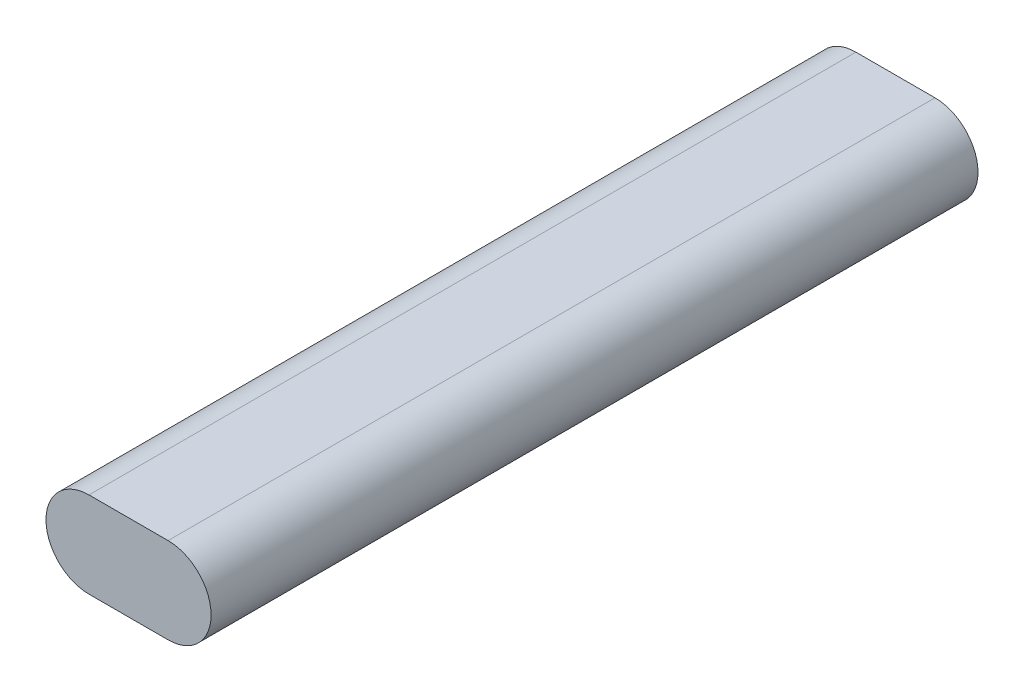
ISO-10303-21;
HEADER;
FILE_DESCRIPTION(('STEP AP214'),'2;1');
FILE_NAME('part.step','',(''),(''),'','','');
FILE_SCHEMA(('AUTOMOTIVE_DESIGN { 1 0 10303 214 1 1 1 1 }'));
ENDSEC;
DATA;
#1=APPLICATION_CONTEXT('core data for automotive mechanical design processes');
#2=APPLICATION_PROTOCOL_DEFINITION('international standard','automotive_design',2000,#1);
#3=PRODUCT_CONTEXT('',#1,'mechanical');
#4=PRODUCT('Part','Part','',(#3));
#5=PRODUCT_RELATED_PRODUCT_CATEGORY('part','',(#4));
#6=PRODUCT_DEFINITION_FORMATION('','',#4);
#7=PRODUCT_DEFINITION_CONTEXT('part definition',#1,'design');
#8=PRODUCT_DEFINITION('design','',#6,#7);
#9=PRODUCT_DEFINITION_SHAPE('','',#8);
#10=(LENGTH_UNIT() NAMED_UNIT(*) SI_UNIT(.MILLI.,.METRE.));
#11=(NAMED_UNIT(*) PLANE_ANGLE_UNIT() SI_UNIT($,.RADIAN.));
#12=(NAMED_UNIT(*) SI_UNIT($,.STERADIAN.) SOLID_ANGLE_UNIT());
#13=UNCERTAINTY_MEASURE_WITH_UNIT(LENGTH_MEASURE(1.E-05),#10,'distance_accuracy_value','');
#14=(GEOMETRIC_REPRESENTATION_CONTEXT(3) GLOBAL_UNCERTAINTY_ASSIGNED_CONTEXT((#13)) GLOBAL_UNIT_ASSIGNED_CONTEXT((#10,
#11,#12)) REPRESENTATION_CONTEXT('',''));
#15=CARTESIAN_POINT('',(0.,0.,0.));
#16=DIRECTION('',(0.,0.,1.));
#17=DIRECTION('',(1.,0.,0.));
#18=AXIS2_PLACEMENT_3D('',#15,#16,#17);
#19=CARTESIAN_POINT('',(-11.5,0.,223.));
#20=DIRECTION('',(0.,0.,-1.));
#21=DIRECTION('',(-1.,0.,0.));
#22=AXIS2_PLACEMENT_3D('',#19,#20,#21);
#23=CYLINDRICAL_SURFACE('',#22,12.5);
#24=CARTESIAN_POINT('',(-11.5,0.,0.));
#25=DIRECTION('',(0.,0.,1.));
#26=DIRECTION('',(1.,0.,0.));
#27=AXIS2_PLACEMENT_3D('',#24,#25,#26);
#28=CIRCLE('',#27,12.5);
#29=CARTESIAN_POINT('',(-11.5,12.5,0.));
#30=VERTEX_POINT('',#29);
#31=CARTESIAN_POINT('',(-11.5,-12.5,0.));
#32=VERTEX_POINT('',#31);
#33=EDGE_CURVE('E98',#30,#32,#28,.T.);
#34=ORIENTED_EDGE('',*,*,#33,.T.);
#35=DIRECTION('',(0.,0.,-1.));
#36=VECTOR('',#35,1.);
#37=CARTESIAN_POINT('',(-11.5,-12.5,223.));
#38=LINE('',#37,#36);
#39=CARTESIAN_POINT('',(-11.5,-12.5,223.));
#40=VERTEX_POINT('',#39);
#41=EDGE_CURVE('E11',#40,#32,#38,.T.);
#42=ORIENTED_EDGE('',*,*,#41,.F.);
#43=CARTESIAN_POINT('',(-11.5,0.,223.));
#44=DIRECTION('',(0.,0.,1.));
#45=DIRECTION('',(1.,0.,0.));
#46=AXIS2_PLACEMENT_3D('',#43,#44,#45);
#47=CIRCLE('',#46,12.5);
#48=CARTESIAN_POINT('',(-11.5,12.5,223.));
#49=VERTEX_POINT('',#48);
#50=EDGE_CURVE('E86',#49,#40,#47,.T.);
#51=ORIENTED_EDGE('',*,*,#50,.F.);
#52=DIRECTION('',(0.,0.,-1.));
#53=VECTOR('',#52,1.);
#54=CARTESIAN_POINT('',(-11.5,12.5,223.));
#55=LINE('',#54,#53);
#56=EDGE_CURVE('E94',#49,#30,#55,.T.);
#57=ORIENTED_EDGE('',*,*,#56,.T.);
#58=EDGE_LOOP('',(#34,#42,#51,#57));
#59=FACE_BOUND('',#58,.T.);
#60=ADVANCED_FACE('F35',(#59),#23,.T.);
#61=CARTESIAN_POINT('',(-11.5,-12.5,223.));
#62=DIRECTION('',(0.,1.,0.));
#63=DIRECTION('',(0.,0.,1.));
#64=AXIS2_PLACEMENT_3D('',#61,#62,#63);
#65=PLANE('',#64);
#66=DIRECTION('',(1.,0.,0.));
#67=VECTOR('',#66,1.);
#68=CARTESIAN_POINT('',(-11.5,-12.5,0.));
#69=LINE('',#68,#67);
#70=CARTESIAN_POINT('',(11.5,-12.5,0.));
#71=VERTEX_POINT('',#70);
#72=EDGE_CURVE('E90',#32,#71,#69,.T.);
#73=ORIENTED_EDGE('',*,*,#72,.T.);
#74=DIRECTION('',(0.,0.,-1.));
#75=VECTOR('',#74,1.);
#76=CARTESIAN_POINT('',(11.5,-12.5,223.));
#77=LINE('',#76,#75);
#78=CARTESIAN_POINT('',(11.5,-12.5,223.));
#79=VERTEX_POINT('',#78);
#80=EDGE_CURVE('E43',#79,#71,#77,.T.);
#81=ORIENTED_EDGE('',*,*,#80,.F.);
#82=DIRECTION('',(1.,0.,0.));
#83=VECTOR('',#82,1.);
#84=CARTESIAN_POINT('',(-11.5,-12.5,223.));
#85=LINE('',#84,#83);
#86=EDGE_CURVE('E81',#40,#79,#85,.T.);
#87=ORIENTED_EDGE('',*,*,#86,.F.);
#88=ORIENTED_EDGE('',*,*,#41,.T.);
#89=EDGE_LOOP('',(#73,#81,#87,#88));
#90=FACE_BOUND('',#89,.T.);
#91=ADVANCED_FACE('F89',(#90),#65,.F.);
#92=CARTESIAN_POINT('',(11.5,0.,223.));
#93=DIRECTION('',(0.,0.,-1.));
#94=DIRECTION('',(-1.,0.,0.));
#95=AXIS2_PLACEMENT_3D('',#92,#93,#94);
#96=CYLINDRICAL_SURFACE('',#95,12.5);
#97=CARTESIAN_POINT('',(11.5,0.,0.));
#98=DIRECTION('',(0.,0.,1.));
#99=DIRECTION('',(1.,0.,0.));
#100=AXIS2_PLACEMENT_3D('',#97,#98,#99);
#101=CIRCLE('',#100,12.5);
#102=CARTESIAN_POINT('',(11.5,12.5,0.));
#103=VERTEX_POINT('',#102);
#104=EDGE_CURVE('E68',#71,#103,#101,.T.);
#105=ORIENTED_EDGE('',*,*,#104,.T.);
#106=DIRECTION('',(0.,0.,-1.));
#107=VECTOR('',#106,1.);
#108=CARTESIAN_POINT('',(11.5,12.5,223.));
#109=LINE('',#108,#107);
#110=CARTESIAN_POINT('',(11.5,12.5,223.));
#111=VERTEX_POINT('',#110);
#112=EDGE_CURVE('E91',#111,#103,#109,.T.);
#113=ORIENTED_EDGE('',*,*,#112,.F.);
#114=CARTESIAN_POINT('',(11.5,0.,223.));
#115=DIRECTION('',(0.,0.,1.));
#116=DIRECTION('',(1.,0.,0.));
#117=AXIS2_PLACEMENT_3D('',#114,#115,#116);
#118=CIRCLE('',#117,12.5);
#119=EDGE_CURVE('E84',#79,#111,#118,.T.);
#120=ORIENTED_EDGE('',*,*,#119,.F.);
#121=ORIENTED_EDGE('',*,*,#80,.T.);
#122=EDGE_LOOP('',(#105,#113,#120,#121));
#123=FACE_BOUND('',#122,.T.);
#124=ADVANCED_FACE('F92',(#123),#96,.T.);
#125=CARTESIAN_POINT('',(-11.5,12.5,223.));
#126=DIRECTION('',(0.,-1.,0.));
#127=DIRECTION('',(0.,0.,-1.));
#128=AXIS2_PLACEMENT_3D('',#125,#126,#127);
#129=PLANE('',#128);
#130=DIRECTION('',(-1.,0.,0.));
#131=VECTOR('',#130,1.);
#132=CARTESIAN_POINT('',(-11.5,12.5,0.));
#133=LINE('',#132,#131);
#134=EDGE_CURVE('E74',#103,#30,#133,.T.);
#135=ORIENTED_EDGE('',*,*,#134,.T.);
#136=ORIENTED_EDGE('',*,*,#56,.F.);
#137=DIRECTION('',(-1.,0.,0.));
#138=VECTOR('',#137,1.);
#139=CARTESIAN_POINT('',(-11.5,12.5,223.));
#140=LINE('',#139,#138);
#141=EDGE_CURVE('E51',#111,#49,#140,.T.);
#142=ORIENTED_EDGE('',*,*,#141,.F.);
#143=ORIENTED_EDGE('',*,*,#112,.T.);
#144=EDGE_LOOP('',(#135,#136,#142,#143));
#145=FACE_BOUND('',#144,.T.);
#146=ADVANCED_FACE('F105',(#145),#129,.F.);
#147=CARTESIAN_POINT('',(-11.5,0.,223.));
#148=DIRECTION('',(0.,0.,1.));
#149=DIRECTION('',(1.,0.,0.));
#150=AXIS2_PLACEMENT_3D('',#147,#148,#149);
#151=PLANE('',#150);
#152=ORIENTED_EDGE('',*,*,#50,.T.);
#153=ORIENTED_EDGE('',*,*,#86,.T.);
#154=ORIENTED_EDGE('',*,*,#119,.T.);
#155=ORIENTED_EDGE('',*,*,#141,.T.);
#156=EDGE_LOOP('',(#152,#153,#154,#155));
#157=FACE_BOUND('',#156,.T.);
#158=ADVANCED_FACE('F82',(#157),#151,.T.);
#159=CARTESIAN_POINT('',(-11.5,0.,0.));
#160=DIRECTION('',(0.,0.,1.));
#161=DIRECTION('',(1.,0.,0.));
#162=AXIS2_PLACEMENT_3D('',#159,#160,#161);
#163=PLANE('',#162);
#164=ORIENTED_EDGE('',*,*,#33,.F.);
#165=ORIENTED_EDGE('',*,*,#134,.F.);
#166=ORIENTED_EDGE('',*,*,#104,.F.);
#167=ORIENTED_EDGE('',*,*,#72,.F.);
#168=EDGE_LOOP('',(#164,#165,#166,#167));
#169=FACE_BOUND('',#168,.T.);
#170=ADVANCED_FACE('F108',(#169),#163,.F.);
#171=CLOSED_SHELL('',(#60,#91,#124,#146,#158,#170));
#172=MANIFOLD_SOLID_BREP('B2',#171);
#173=ADVANCED_BREP_SHAPE_REPRESENTATION('',(#18,#172),#14);
#174=SHAPE_DEFINITION_REPRESENTATION(#9,#173);
ENDSEC;
END-ISO-10303-21;
